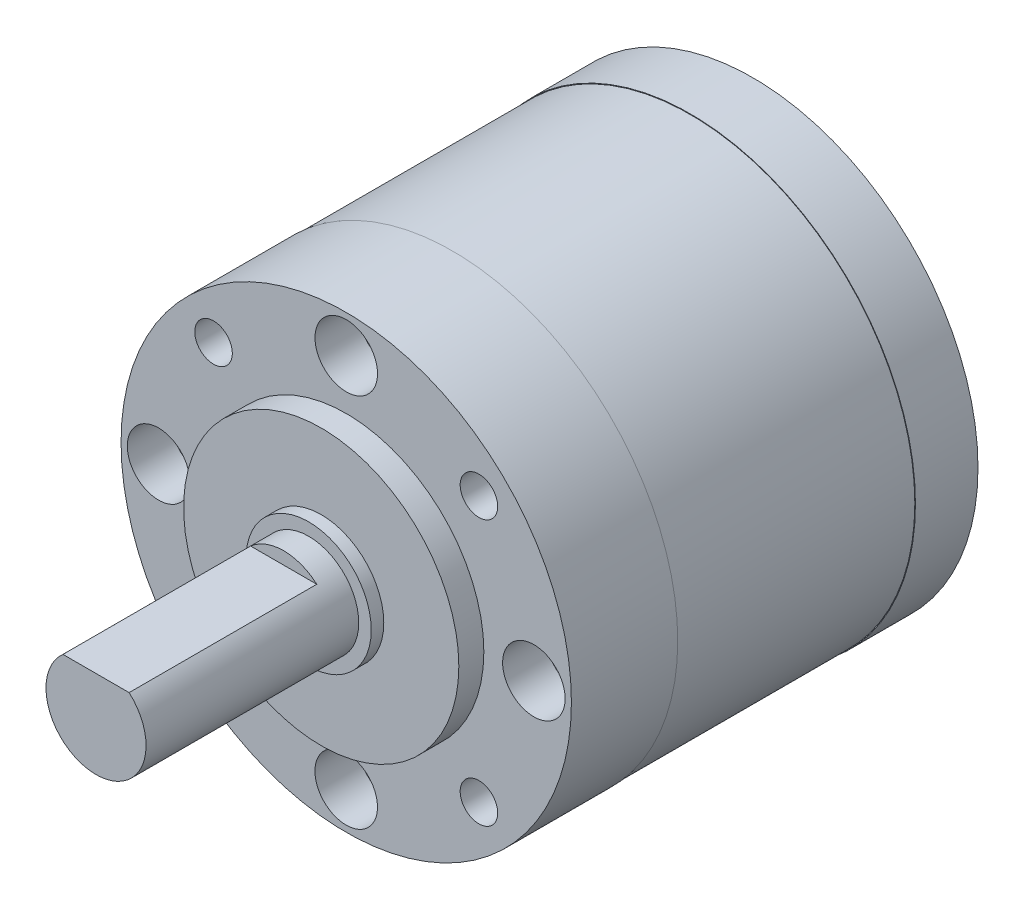
ISO-10303-21;
HEADER;
FILE_DESCRIPTION(('STEP AP214'),'2;1');
FILE_NAME('part.step','',(''),(''),'','','');
FILE_SCHEMA(('AUTOMOTIVE_DESIGN { 1 0 10303 214 1 1 1 1 }'));
ENDSEC;
DATA;
#1=APPLICATION_CONTEXT('core data for automotive mechanical design processes');
#2=APPLICATION_PROTOCOL_DEFINITION('international standard','automotive_design',2000,#1);
#3=PRODUCT_CONTEXT('',#1,'mechanical');
#4=PRODUCT('Part','Part','',(#3));
#5=PRODUCT_RELATED_PRODUCT_CATEGORY('part','',(#4));
#6=PRODUCT_DEFINITION_FORMATION('','',#4);
#7=PRODUCT_DEFINITION_CONTEXT('part definition',#1,'design');
#8=PRODUCT_DEFINITION('design','',#6,#7);
#9=PRODUCT_DEFINITION_SHAPE('','',#8);
#10=(LENGTH_UNIT() NAMED_UNIT(*) SI_UNIT(.MILLI.,.METRE.));
#11=(NAMED_UNIT(*) PLANE_ANGLE_UNIT() SI_UNIT($,.RADIAN.));
#12=(NAMED_UNIT(*) SI_UNIT($,.STERADIAN.) SOLID_ANGLE_UNIT());
#13=UNCERTAINTY_MEASURE_WITH_UNIT(LENGTH_MEASURE(1.E-05),#10,'distance_accuracy_value','');
#14=(GEOMETRIC_REPRESENTATION_CONTEXT(3) GLOBAL_UNCERTAINTY_ASSIGNED_CONTEXT((#13)) GLOBAL_UNIT_ASSIGNED_CONTEXT((#10,
#11,#12)) REPRESENTATION_CONTEXT('',''));
#15=CARTESIAN_POINT('',(0.,0.,0.));
#16=DIRECTION('',(0.,0.,1.));
#17=DIRECTION('',(1.,0.,0.));
#18=AXIS2_PLACEMENT_3D('',#15,#16,#17);
#19=CARTESIAN_POINT('',(0.,0.,8.5));
#20=DIRECTION('',(0.,0.,-1.));
#21=DIRECTION('',(-1.,0.,0.));
#22=AXIS2_PLACEMENT_3D('',#19,#20,#21);
#23=CYLINDRICAL_SURFACE('',#22,18.);
#24=CARTESIAN_POINT('',(0.,0.,8.5));
#25=DIRECTION('',(0.,0.,1.));
#26=DIRECTION('',(1.,0.,0.));
#27=AXIS2_PLACEMENT_3D('',#24,#25,#26);
#28=CIRCLE('',#27,18.);
#29=CARTESIAN_POINT('',(18.,0.,8.5));
#30=VERTEX_POINT('',#29);
#31=EDGE_CURVE('E105',#30,#30,#28,.T.);
#32=ORIENTED_EDGE('',*,*,#31,.F.);
#33=EDGE_LOOP('',(#32));
#34=FACE_BOUND('',#33,.T.);
#35=CARTESIAN_POINT('',(0.,0.,0.));
#36=DIRECTION('',(0.,0.,1.));
#37=DIRECTION('',(1.,0.,0.));
#38=AXIS2_PLACEMENT_3D('',#35,#36,#37);
#39=CIRCLE('',#38,18.);
#40=CARTESIAN_POINT('',(18.,0.,0.));
#41=VERTEX_POINT('',#40);
#42=EDGE_CURVE('E104',#41,#41,#39,.T.);
#43=ORIENTED_EDGE('',*,*,#42,.T.);
#44=EDGE_LOOP('',(#43));
#45=FACE_BOUND('',#44,.T.);
#46=ADVANCED_FACE('F35',(#34,#45),#23,.T.);
#47=CARTESIAN_POINT('',(0.,0.,8.5));
#48=DIRECTION('',(0.,0.,1.));
#49=DIRECTION('',(1.,0.,0.));
#50=AXIS2_PLACEMENT_3D('',#47,#48,#49);
#51=PLANE('',#50);
#52=CARTESIAN_POINT('',(0.,-15.,8.5));
#53=DIRECTION('',(0.,0.,1.));
#54=DIRECTION('',(-1.,0.,0.));
#55=AXIS2_PLACEMENT_3D('',#52,#53,#54);
#56=CIRCLE('',#55,2.5);
#57=CARTESIAN_POINT('',(-2.5,-15.,8.5));
#58=VERTEX_POINT('',#57);
#59=EDGE_CURVE('E134',#58,#58,#56,.T.);
#60=ORIENTED_EDGE('',*,*,#59,.F.);
#61=EDGE_LOOP('',(#60));
#62=FACE_BOUND('',#61,.T.);
#63=CARTESIAN_POINT('',(15.,1.57116660247941E-13,8.5));
#64=DIRECTION('',(0.,0.,1.));
#65=DIRECTION('',(0.,-1.,0.));
#66=AXIS2_PLACEMENT_3D('',#63,#64,#65);
#67=CIRCLE('',#66,2.5);
#68=CARTESIAN_POINT('',(15.,-2.49999999999984,8.5));
#69=VERTEX_POINT('',#68);
#70=EDGE_CURVE('E144',#69,#69,#67,.T.);
#71=ORIENTED_EDGE('',*,*,#70,.F.);
#72=EDGE_LOOP('',(#71));
#73=FACE_BOUND('',#72,.T.);
#74=CARTESIAN_POINT('',(-15.,0.,8.5));
#75=DIRECTION('',(0.,0.,1.));
#76=DIRECTION('',(0.,1.,0.));
#77=AXIS2_PLACEMENT_3D('',#74,#75,#76);
#78=CIRCLE('',#77,2.5);
#79=CARTESIAN_POINT('',(-15.,2.49999999999995,8.5));
#80=VERTEX_POINT('',#79);
#81=EDGE_CURVE('E132',#80,#80,#78,.T.);
#82=ORIENTED_EDGE('',*,*,#81,.F.);
#83=EDGE_LOOP('',(#82));
#84=FACE_BOUND('',#83,.T.);
#85=CARTESIAN_POINT('',(0.,15.,8.5));
#86=DIRECTION('',(0.,0.,1.));
#87=DIRECTION('',(1.,0.,0.));
#88=AXIS2_PLACEMENT_3D('',#85,#86,#87);
#89=CIRCLE('',#88,2.5);
#90=CARTESIAN_POINT('',(2.5,15.,8.5));
#91=VERTEX_POINT('',#90);
#92=EDGE_CURVE('E124',#91,#91,#89,.T.);
#93=ORIENTED_EDGE('',*,*,#92,.F.);
#94=EDGE_LOOP('',(#93));
#95=FACE_BOUND('',#94,.T.);
#96=CARTESIAN_POINT('',(-10.6066017177982,-10.6066017177983,8.5));
#97=DIRECTION('',(0.,0.,1.));
#98=DIRECTION('',(-0.707106781186551,0.707106781186544,0.));
#99=AXIS2_PLACEMENT_3D('',#96,#97,#98);
#100=CIRCLE('',#99,1.5);
#101=CARTESIAN_POINT('',(-11.667261889578,-9.54594154601845,8.5));
#102=VERTEX_POINT('',#101);
#103=EDGE_CURVE('E162',#102,#102,#100,.T.);
#104=ORIENTED_EDGE('',*,*,#103,.F.);
#105=EDGE_LOOP('',(#104));
#106=FACE_BOUND('',#105,.T.);
#107=CARTESIAN_POINT('',(10.6066017177983,-10.6066017177981,8.5));
#108=DIRECTION('',(0.,0.,1.));
#109=DIRECTION('',(-0.707106781186541,-0.707106781186554,0.));
#110=AXIS2_PLACEMENT_3D('',#107,#108,#109);
#111=CIRCLE('',#110,1.5);
#112=CARTESIAN_POINT('',(9.54594154601849,-11.667261889578,8.5));
#113=VERTEX_POINT('',#112);
#114=EDGE_CURVE('E171',#113,#113,#111,.T.);
#115=ORIENTED_EDGE('',*,*,#114,.F.);
#116=EDGE_LOOP('',(#115));
#117=FACE_BOUND('',#116,.T.);
#118=CARTESIAN_POINT('',(10.6066017177981,10.6066017177983,8.5));
#119=DIRECTION('',(0.,0.,1.));
#120=DIRECTION('',(0.707106781186556,-0.707106781186539,0.));
#121=AXIS2_PLACEMENT_3D('',#118,#119,#120);
#122=CIRCLE('',#121,1.5);
#123=CARTESIAN_POINT('',(11.6672618895779,9.54594154601853,8.5));
#124=VERTEX_POINT('',#123);
#125=EDGE_CURVE('E120',#124,#124,#122,.T.);
#126=ORIENTED_EDGE('',*,*,#125,.F.);
#127=EDGE_LOOP('',(#126));
#128=FACE_BOUND('',#127,.T.);
#129=CARTESIAN_POINT('',(-10.6066017177982,10.6066017177982,8.5));
#130=DIRECTION('',(0.,0.,1.));
#131=DIRECTION('',(0.707106781186546,0.707106781186549,0.));
#132=AXIS2_PLACEMENT_3D('',#129,#130,#131);
#133=CIRCLE('',#132,1.5);
#134=CARTESIAN_POINT('',(-9.54594154601841,11.667261889578,8.5));
#135=VERTEX_POINT('',#134);
#136=EDGE_CURVE('E158',#135,#135,#133,.T.);
#137=ORIENTED_EDGE('',*,*,#136,.F.);
#138=EDGE_LOOP('',(#137));
#139=FACE_BOUND('',#138,.T.);
#140=CARTESIAN_POINT('',(0.,0.,8.5));
#141=DIRECTION('',(0.,0.,1.));
#142=DIRECTION('',(1.,0.,0.));
#143=AXIS2_PLACEMENT_3D('',#140,#141,#142);
#144=CIRCLE('',#143,11.);
#145=CARTESIAN_POINT('',(11.,0.,8.5));
#146=VERTEX_POINT('',#145);
#147=EDGE_CURVE('E87',#146,#146,#144,.T.);
#148=ORIENTED_EDGE('',*,*,#147,.F.);
#149=EDGE_LOOP('',(#148));
#150=FACE_BOUND('',#149,.T.);
#151=ORIENTED_EDGE('',*,*,#31,.T.);
#152=EDGE_LOOP('',(#151));
#153=FACE_BOUND('',#152,.T.);
#154=ADVANCED_FACE('F224',(#62,#73,#84,#95,#106,#117,#128,#139,#150,#153),#51,.T.);
#155=CARTESIAN_POINT('',(0.,0.,0.));
#156=DIRECTION('',(0.,0.,1.));
#157=DIRECTION('',(1.,0.,0.));
#158=AXIS2_PLACEMENT_3D('',#155,#156,#157);
#159=PLANE('',#158);
#160=CARTESIAN_POINT('',(0.,0.,0.));
#161=DIRECTION('',(0.,0.,1.));
#162=DIRECTION('',(1.,0.,0.));
#163=AXIS2_PLACEMENT_3D('',#160,#161,#162);
#164=CIRCLE('',#163,17.95);
#165=CARTESIAN_POINT('',(17.95,0.,0.));
#166=VERTEX_POINT('',#165);
#167=EDGE_CURVE('E44',#166,#166,#164,.F.);
#168=ORIENTED_EDGE('',*,*,#167,.F.);
#169=EDGE_LOOP('',(#168));
#170=FACE_BOUND('',#169,.T.);
#171=ORIENTED_EDGE('',*,*,#42,.F.);
#172=EDGE_LOOP('',(#171));
#173=FACE_BOUND('',#172,.T.);
#174=ADVANCED_FACE('F229',(#170,#173),#159,.F.);
#175=CARTESIAN_POINT('',(0.,0.,-19.));
#176=DIRECTION('',(0.,0.,1.));
#177=DIRECTION('',(1.,0.,0.));
#178=AXIS2_PLACEMENT_3D('',#175,#176,#177);
#179=CYLINDRICAL_SURFACE('',#178,17.95);
#180=CARTESIAN_POINT('',(0.,0.,-19.));
#181=DIRECTION('',(0.,0.,-1.));
#182=DIRECTION('',(-1.,0.,0.));
#183=AXIS2_PLACEMENT_3D('',#180,#181,#182);
#184=CIRCLE('',#183,17.95);
#185=CARTESIAN_POINT('',(-17.95,0.,-19.));
#186=VERTEX_POINT('',#185);
#187=EDGE_CURVE('E99',#186,#186,#184,.T.);
#188=ORIENTED_EDGE('',*,*,#187,.F.);
#189=EDGE_LOOP('',(#188));
#190=FACE_BOUND('',#189,.T.);
#191=ORIENTED_EDGE('',*,*,#167,.T.);
#192=EDGE_LOOP('',(#191));
#193=FACE_BOUND('',#192,.T.);
#194=ADVANCED_FACE('F209',(#190,#193),#179,.T.);
#195=CARTESIAN_POINT('',(0.,0.,-24.));
#196=DIRECTION('',(0.,0.,1.));
#197=DIRECTION('',(1.,0.,0.));
#198=AXIS2_PLACEMENT_3D('',#195,#196,#197);
#199=CYLINDRICAL_SURFACE('',#198,18.);
#200=CARTESIAN_POINT('',(0.,0.,-24.));
#201=DIRECTION('',(0.,0.,-1.));
#202=DIRECTION('',(-1.,0.,0.));
#203=AXIS2_PLACEMENT_3D('',#200,#201,#202);
#204=CIRCLE('',#203,18.);
#205=CARTESIAN_POINT('',(-18.,0.,-24.));
#206=VERTEX_POINT('',#205);
#207=EDGE_CURVE('E96',#206,#206,#204,.T.);
#208=ORIENTED_EDGE('',*,*,#207,.F.);
#209=EDGE_LOOP('',(#208));
#210=FACE_BOUND('',#209,.T.);
#211=CARTESIAN_POINT('',(0.,0.,-19.));
#212=DIRECTION('',(0.,0.,-1.));
#213=DIRECTION('',(-1.,0.,0.));
#214=AXIS2_PLACEMENT_3D('',#211,#212,#213);
#215=CIRCLE('',#214,18.);
#216=CARTESIAN_POINT('',(-18.,0.,-19.));
#217=VERTEX_POINT('',#216);
#218=EDGE_CURVE('E93',#217,#217,#215,.T.);
#219=ORIENTED_EDGE('',*,*,#218,.T.);
#220=EDGE_LOOP('',(#219));
#221=FACE_BOUND('',#220,.T.);
#222=ADVANCED_FACE('F203',(#210,#221),#199,.T.);
#223=CARTESIAN_POINT('',(0.,0.,-24.));
#224=DIRECTION('',(0.,0.,-1.));
#225=DIRECTION('',(-1.,0.,0.));
#226=AXIS2_PLACEMENT_3D('',#223,#224,#225);
#227=PLANE('',#226);
#228=CARTESIAN_POINT('',(0.,0.,-24.));
#229=DIRECTION('',(0.,0.,-1.));
#230=DIRECTION('',(-1.,0.,0.));
#231=AXIS2_PLACEMENT_3D('',#228,#229,#230);
#232=CIRCLE('',#231,11.);
#233=CARTESIAN_POINT('',(-11.,0.,-24.));
#234=VERTEX_POINT('',#233);
#235=EDGE_CURVE('E115',#234,#234,#232,.T.);
#236=ORIENTED_EDGE('',*,*,#235,.F.);
#237=EDGE_LOOP('',(#236));
#238=FACE_BOUND('',#237,.T.);
#239=ORIENTED_EDGE('',*,*,#207,.T.);
#240=EDGE_LOOP('',(#239));
#241=FACE_BOUND('',#240,.T.);
#242=ADVANCED_FACE('F199',(#238,#241),#227,.T.);
#243=CARTESIAN_POINT('',(0.,0.,-19.));
#244=DIRECTION('',(0.,0.,-1.));
#245=DIRECTION('',(-1.,0.,0.));
#246=AXIS2_PLACEMENT_3D('',#243,#244,#245);
#247=PLANE('',#246);
#248=ORIENTED_EDGE('',*,*,#187,.T.);
#249=EDGE_LOOP('',(#248));
#250=FACE_BOUND('',#249,.T.);
#251=ORIENTED_EDGE('',*,*,#218,.F.);
#252=EDGE_LOOP('',(#251));
#253=FACE_BOUND('',#252,.T.);
#254=ADVANCED_FACE('F202',(#250,#253),#247,.F.);
#255=CARTESIAN_POINT('',(0.,0.,10.5));
#256=DIRECTION('',(0.,0.,-1.));
#257=DIRECTION('',(-1.,0.,0.));
#258=AXIS2_PLACEMENT_3D('',#255,#256,#257);
#259=CYLINDRICAL_SURFACE('',#258,11.);
#260=CARTESIAN_POINT('',(0.,0.,10.5));
#261=DIRECTION('',(0.,0.,1.));
#262=DIRECTION('',(1.,0.,0.));
#263=AXIS2_PLACEMENT_3D('',#260,#261,#262);
#264=CIRCLE('',#263,11.);
#265=CARTESIAN_POINT('',(11.,0.,10.5));
#266=VERTEX_POINT('',#265);
#267=EDGE_CURVE('E90',#266,#266,#264,.T.);
#268=ORIENTED_EDGE('',*,*,#267,.F.);
#269=EDGE_LOOP('',(#268));
#270=FACE_BOUND('',#269,.T.);
#271=ORIENTED_EDGE('',*,*,#147,.T.);
#272=EDGE_LOOP('',(#271));
#273=FACE_BOUND('',#272,.T.);
#274=ADVANCED_FACE('F214',(#270,#273),#259,.T.);
#275=CARTESIAN_POINT('',(0.,0.,10.5));
#276=DIRECTION('',(0.,0.,1.));
#277=DIRECTION('',(1.,0.,0.));
#278=AXIS2_PLACEMENT_3D('',#275,#276,#277);
#279=PLANE('',#278);
#280=CARTESIAN_POINT('',(0.,0.,10.5));
#281=DIRECTION('',(0.,0.,1.));
#282=DIRECTION('',(1.,0.,0.));
#283=AXIS2_PLACEMENT_3D('',#280,#281,#282);
#284=CIRCLE('',#283,5.);
#285=CARTESIAN_POINT('',(5.,0.,10.5));
#286=VERTEX_POINT('',#285);
#287=EDGE_CURVE('E81',#286,#286,#284,.T.);
#288=ORIENTED_EDGE('',*,*,#287,.F.);
#289=EDGE_LOOP('',(#288));
#290=FACE_BOUND('',#289,.T.);
#291=ORIENTED_EDGE('',*,*,#267,.T.);
#292=EDGE_LOOP('',(#291));
#293=FACE_BOUND('',#292,.T.);
#294=ADVANCED_FACE('F220',(#290,#293),#279,.T.);
#295=CARTESIAN_POINT('',(0.,0.,11.5));
#296=DIRECTION('',(0.,0.,-1.));
#297=DIRECTION('',(-1.,0.,0.));
#298=AXIS2_PLACEMENT_3D('',#295,#296,#297);
#299=CYLINDRICAL_SURFACE('',#298,5.);
#300=CARTESIAN_POINT('',(0.,0.,11.5));
#301=DIRECTION('',(0.,0.,1.));
#302=DIRECTION('',(1.,0.,0.));
#303=AXIS2_PLACEMENT_3D('',#300,#301,#302);
#304=CIRCLE('',#303,5.);
#305=CARTESIAN_POINT('',(5.,0.,11.5));
#306=VERTEX_POINT('',#305);
#307=EDGE_CURVE('E84',#306,#306,#304,.T.);
#308=ORIENTED_EDGE('',*,*,#307,.F.);
#309=EDGE_LOOP('',(#308));
#310=FACE_BOUND('',#309,.T.);
#311=ORIENTED_EDGE('',*,*,#287,.T.);
#312=EDGE_LOOP('',(#311));
#313=FACE_BOUND('',#312,.T.);
#314=ADVANCED_FACE('F567',(#310,#313),#299,.T.);
#315=CARTESIAN_POINT('',(0.,0.,11.5));
#316=DIRECTION('',(0.,0.,1.));
#317=DIRECTION('',(1.,0.,0.));
#318=AXIS2_PLACEMENT_3D('',#315,#316,#317);
#319=PLANE('',#318);
#320=CARTESIAN_POINT('',(0.,0.,11.5));
#321=DIRECTION('',(0.,0.,1.));
#322=DIRECTION('',(1.,0.,0.));
#323=AXIS2_PLACEMENT_3D('',#320,#321,#322);
#324=CIRCLE('',#323,4.);
#325=CARTESIAN_POINT('',(4.,0.,11.5));
#326=VERTEX_POINT('',#325);
#327=EDGE_CURVE('E77',#326,#326,#324,.T.);
#328=ORIENTED_EDGE('',*,*,#327,.F.);
#329=EDGE_LOOP('',(#328));
#330=FACE_BOUND('',#329,.T.);
#331=ORIENTED_EDGE('',*,*,#307,.T.);
#332=EDGE_LOOP('',(#331));
#333=FACE_BOUND('',#332,.T.);
#334=ADVANCED_FACE('F564',(#330,#333),#319,.T.);
#335=CARTESIAN_POINT('',(0.,0.,28.5));
#336=DIRECTION('',(0.,0.,-1.));
#337=DIRECTION('',(-1.,0.,0.));
#338=AXIS2_PLACEMENT_3D('',#335,#336,#337);
#339=CYLINDRICAL_SURFACE('',#338,4.);
#340=CARTESIAN_POINT('',(0.,0.,28.5));
#341=DIRECTION('',(0.,0.,1.));
#342=DIRECTION('',(1.,0.,0.));
#343=AXIS2_PLACEMENT_3D('',#340,#341,#342);
#344=CIRCLE('',#343,4.);
#345=CARTESIAN_POINT('',(-2.64575131106459,3.,28.5));
#346=VERTEX_POINT('',#345);
#347=CARTESIAN_POINT('',(2.64575131106459,3.,28.5));
#348=VERTEX_POINT('',#347);
#349=EDGE_CURVE('E75',#346,#348,#344,.T.);
#350=ORIENTED_EDGE('',*,*,#349,.F.);
#351=DIRECTION('',(0.,0.,1.));
#352=VECTOR('',#351,1.);
#353=CARTESIAN_POINT('',(-2.64575131106459,3.,13.5));
#354=LINE('',#353,#352);
#355=CARTESIAN_POINT('',(-2.64575131106459,3.,13.5));
#356=VERTEX_POINT('',#355);
#357=EDGE_CURVE('E50',#356,#346,#354,.T.);
#358=ORIENTED_EDGE('',*,*,#357,.F.);
#359=CARTESIAN_POINT('',(0.,0.,13.5));
#360=DIRECTION('',(0.,0.,1.));
#361=DIRECTION('',(1.,0.,0.));
#362=AXIS2_PLACEMENT_3D('',#359,#360,#361);
#363=CIRCLE('',#362,4.);
#364=CARTESIAN_POINT('',(2.64575131106459,3.,13.5));
#365=VERTEX_POINT('',#364);
#366=EDGE_CURVE('E61',#365,#356,#363,.T.);
#367=ORIENTED_EDGE('',*,*,#366,.F.);
#368=DIRECTION('',(0.,0.,1.));
#369=VECTOR('',#368,1.);
#370=CARTESIAN_POINT('',(2.64575131106459,3.,13.5));
#371=LINE('',#370,#369);
#372=EDGE_CURVE('E69',#365,#348,#371,.T.);
#373=ORIENTED_EDGE('',*,*,#372,.T.);
#374=EDGE_LOOP('',(#350,#358,#367,#373));
#375=FACE_BOUND('',#374,.T.);
#376=ORIENTED_EDGE('',*,*,#327,.T.);
#377=EDGE_LOOP('',(#376));
#378=FACE_BOUND('',#377,.T.);
#379=ADVANCED_FACE('F72',(#375,#378),#339,.T.);
#380=CARTESIAN_POINT('',(0.,0.,28.5));
#381=DIRECTION('',(0.,0.,1.));
#382=DIRECTION('',(1.,0.,0.));
#383=AXIS2_PLACEMENT_3D('',#380,#381,#382);
#384=PLANE('',#383);
#385=DIRECTION('',(1.,0.,0.));
#386=VECTOR('',#385,1.);
#387=CARTESIAN_POINT('',(0.,3.,28.5));
#388=LINE('',#387,#386);
#389=EDGE_CURVE('E11',#346,#348,#388,.T.);
#390=ORIENTED_EDGE('',*,*,#389,.F.);
#391=ORIENTED_EDGE('',*,*,#349,.T.);
#392=EDGE_LOOP('',(#390,#391));
#393=FACE_BOUND('',#392,.T.);
#394=ADVANCED_FACE('F558',(#393),#384,.T.);
#395=CARTESIAN_POINT('',(0.,3.,13.5));
#396=DIRECTION('',(0.,-1.,0.));
#397=DIRECTION('',(0.,0.,-1.));
#398=AXIS2_PLACEMENT_3D('',#395,#396,#397);
#399=PLANE('',#398);
#400=ORIENTED_EDGE('',*,*,#389,.T.);
#401=ORIENTED_EDGE('',*,*,#372,.F.);
#402=DIRECTION('',(1.,0.,0.));
#403=VECTOR('',#402,1.);
#404=CARTESIAN_POINT('',(0.,3.,13.5));
#405=LINE('',#404,#403);
#406=EDGE_CURVE('E63',#356,#365,#405,.T.);
#407=ORIENTED_EDGE('',*,*,#406,.F.);
#408=ORIENTED_EDGE('',*,*,#357,.T.);
#409=EDGE_LOOP('',(#400,#401,#407,#408));
#410=FACE_BOUND('',#409,.T.);
#411=ADVANCED_FACE('F68',(#410),#399,.F.);
#412=CARTESIAN_POINT('',(0.,0.,13.5));
#413=DIRECTION('',(0.,0.,1.));
#414=DIRECTION('',(1.,0.,0.));
#415=AXIS2_PLACEMENT_3D('',#412,#413,#414);
#416=PLANE('',#415);
#417=ORIENTED_EDGE('',*,*,#366,.T.);
#418=ORIENTED_EDGE('',*,*,#406,.T.);
#419=EDGE_LOOP('',(#417,#418));
#420=FACE_BOUND('',#419,.T.);
#421=ADVANCED_FACE('F62',(#420),#416,.T.);
#422=CARTESIAN_POINT('',(0.,0.,-20.));
#423=DIRECTION('',(0.,0.,-1.));
#424=DIRECTION('',(-1.,0.,0.));
#425=AXIS2_PLACEMENT_3D('',#422,#423,#424);
#426=CYLINDRICAL_SURFACE('',#425,11.);
#427=CARTESIAN_POINT('',(0.,0.,-20.));
#428=DIRECTION('',(0.,0.,-1.));
#429=DIRECTION('',(-1.,0.,0.));
#430=AXIS2_PLACEMENT_3D('',#427,#428,#429);
#431=CIRCLE('',#430,11.);
#432=CARTESIAN_POINT('',(-11.,0.,-20.));
#433=VERTEX_POINT('',#432);
#434=EDGE_CURVE('E66',#433,#433,#431,.T.);
#435=ORIENTED_EDGE('',*,*,#434,.F.);
#436=EDGE_LOOP('',(#435));
#437=FACE_BOUND('',#436,.T.);
#438=ORIENTED_EDGE('',*,*,#235,.T.);
#439=EDGE_LOOP('',(#438));
#440=FACE_BOUND('',#439,.T.);
#441=ADVANCED_FACE('F197',(#437,#440),#426,.F.);
#442=CARTESIAN_POINT('',(0.,0.,-20.));
#443=DIRECTION('',(0.,0.,-1.));
#444=DIRECTION('',(-1.,0.,0.));
#445=AXIS2_PLACEMENT_3D('',#442,#443,#444);
#446=PLANE('',#445);
#447=CARTESIAN_POINT('',(0.,0.,-20.));
#448=DIRECTION('',(0.,0.,-1.));
#449=DIRECTION('',(-1.,0.,0.));
#450=AXIS2_PLACEMENT_3D('',#447,#448,#449);
#451=CIRCLE('',#450,4.);
#452=CARTESIAN_POINT('',(-4.,0.,-20.));
#453=VERTEX_POINT('',#452);
#454=EDGE_CURVE('E112',#453,#453,#451,.T.);
#455=ORIENTED_EDGE('',*,*,#454,.F.);
#456=EDGE_LOOP('',(#455));
#457=FACE_BOUND('',#456,.T.);
#458=ORIENTED_EDGE('',*,*,#434,.T.);
#459=EDGE_LOOP('',(#458));
#460=FACE_BOUND('',#459,.T.);
#461=ADVANCED_FACE('F271',(#457,#460),#446,.T.);
#462=CARTESIAN_POINT('',(0.,0.,-7.));
#463=DIRECTION('',(0.,0.,-1.));
#464=DIRECTION('',(-1.,0.,0.));
#465=AXIS2_PLACEMENT_3D('',#462,#463,#464);
#466=CYLINDRICAL_SURFACE('',#465,4.);
#467=ORIENTED_EDGE('',*,*,#454,.T.);
#468=EDGE_LOOP('',(#467));
#469=FACE_BOUND('',#468,.T.);
#470=CARTESIAN_POINT('',(0.,0.,-7.));
#471=DIRECTION('',(0.,0.,-1.));
#472=DIRECTION('',(-1.,0.,0.));
#473=AXIS2_PLACEMENT_3D('',#470,#471,#472);
#474=CIRCLE('',#473,4.);
#475=CARTESIAN_POINT('',(-4.,0.,-7.));
#476=VERTEX_POINT('',#475);
#477=EDGE_CURVE('E116',#476,#476,#474,.T.);
#478=ORIENTED_EDGE('',*,*,#477,.F.);
#479=EDGE_LOOP('',(#478));
#480=FACE_BOUND('',#479,.T.);
#481=ADVANCED_FACE('F281',(#469,#480),#466,.F.);
#482=CARTESIAN_POINT('',(0.,0.,-7.));
#483=DIRECTION('',(0.,0.,-1.));
#484=DIRECTION('',(-1.,0.,0.));
#485=AXIS2_PLACEMENT_3D('',#482,#483,#484);
#486=PLANE('',#485);
#487=ORIENTED_EDGE('',*,*,#477,.T.);
#488=EDGE_LOOP('',(#487));
#489=FACE_BOUND('',#488,.T.);
#490=ADVANCED_FACE('F291',(#489),#486,.T.);
#491=CARTESIAN_POINT('',(-10.6066017177982,10.6066017177982,-1.5));
#492=DIRECTION('',(0.,0.,1.));
#493=DIRECTION('',(1.,0.,0.));
#494=AXIS2_PLACEMENT_3D('',#491,#492,#493);
#495=CYLINDRICAL_SURFACE('',#494,1.5);
#496=CARTESIAN_POINT('',(-10.6066017177982,10.6066017177982,-1.5));
#497=DIRECTION('',(0.,0.,1.));
#498=DIRECTION('',(0.707106781186546,0.707106781186549,0.));
#499=AXIS2_PLACEMENT_3D('',#496,#497,#498);
#500=CIRCLE('',#499,1.5);
#501=CARTESIAN_POINT('',(-9.54594154601841,11.667261889578,-1.5));
#502=VERTEX_POINT('',#501);
#503=EDGE_CURVE('E182',#502,#502,#500,.T.);
#504=ORIENTED_EDGE('',*,*,#503,.F.);
#505=EDGE_LOOP('',(#504));
#506=FACE_BOUND('',#505,.T.);
#507=ORIENTED_EDGE('',*,*,#136,.T.);
#508=EDGE_LOOP('',(#507));
#509=FACE_BOUND('',#508,.T.);
#510=ADVANCED_FACE('F301',(#506,#509),#495,.F.);
#511=CARTESIAN_POINT('',(-10.6066017177982,10.6066017177982,-1.5));
#512=DIRECTION('',(0.,0.,1.));
#513=DIRECTION('',(0.707106781186546,0.707106781186549,0.));
#514=AXIS2_PLACEMENT_3D('',#511,#512,#513);
#515=PLANE('',#514);
#516=ORIENTED_EDGE('',*,*,#503,.T.);
#517=EDGE_LOOP('',(#516));
#518=FACE_BOUND('',#517,.T.);
#519=ADVANCED_FACE('F325',(#518),#515,.T.);
#520=CARTESIAN_POINT('',(10.6066017177981,10.6066017177983,-1.5));
#521=DIRECTION('',(0.,0.,1.));
#522=DIRECTION('',(1.,0.,0.));
#523=AXIS2_PLACEMENT_3D('',#520,#521,#522);
#524=CYLINDRICAL_SURFACE('',#523,1.5);
#525=CARTESIAN_POINT('',(10.6066017177981,10.6066017177983,-1.5));
#526=DIRECTION('',(0.,0.,1.));
#527=DIRECTION('',(0.707106781186556,-0.707106781186539,0.));
#528=AXIS2_PLACEMENT_3D('',#525,#526,#527);
#529=CIRCLE('',#528,1.5);
#530=CARTESIAN_POINT('',(11.6672618895779,9.54594154601853,-1.5));
#531=VERTEX_POINT('',#530);
#532=EDGE_CURVE('E177',#531,#531,#529,.T.);
#533=ORIENTED_EDGE('',*,*,#532,.F.);
#534=EDGE_LOOP('',(#533));
#535=FACE_BOUND('',#534,.T.);
#536=ORIENTED_EDGE('',*,*,#125,.T.);
#537=EDGE_LOOP('',(#536));
#538=FACE_BOUND('',#537,.T.);
#539=ADVANCED_FACE('F335',(#535,#538),#524,.F.);
#540=CARTESIAN_POINT('',(10.6066017177981,10.6066017177983,-1.5));
#541=DIRECTION('',(0.,0.,1.));
#542=DIRECTION('',(0.707106781186556,-0.707106781186539,0.));
#543=AXIS2_PLACEMENT_3D('',#540,#541,#542);
#544=PLANE('',#543);
#545=ORIENTED_EDGE('',*,*,#532,.T.);
#546=EDGE_LOOP('',(#545));
#547=FACE_BOUND('',#546,.T.);
#548=ADVANCED_FACE('F345',(#547),#544,.T.);
#549=CARTESIAN_POINT('',(10.6066017177983,-10.6066017177981,-1.5));
#550=DIRECTION('',(0.,0.,1.));
#551=DIRECTION('',(1.,0.,0.));
#552=AXIS2_PLACEMENT_3D('',#549,#550,#551);
#553=CYLINDRICAL_SURFACE('',#552,1.5);
#554=CARTESIAN_POINT('',(10.6066017177983,-10.6066017177981,-1.5));
#555=DIRECTION('',(0.,0.,1.));
#556=DIRECTION('',(-0.707106781186541,-0.707106781186554,0.));
#557=AXIS2_PLACEMENT_3D('',#554,#555,#556);
#558=CIRCLE('',#557,1.5);
#559=CARTESIAN_POINT('',(9.54594154601849,-11.667261889578,-1.5));
#560=VERTEX_POINT('',#559);
#561=EDGE_CURVE('E168',#560,#560,#558,.T.);
#562=ORIENTED_EDGE('',*,*,#561,.F.);
#563=EDGE_LOOP('',(#562));
#564=FACE_BOUND('',#563,.T.);
#565=ORIENTED_EDGE('',*,*,#114,.T.);
#566=EDGE_LOOP('',(#565));
#567=FACE_BOUND('',#566,.T.);
#568=ADVANCED_FACE('F355',(#564,#567),#553,.F.);
#569=CARTESIAN_POINT('',(10.6066017177983,-10.6066017177981,-1.5));
#570=DIRECTION('',(0.,0.,1.));
#571=DIRECTION('',(-0.707106781186541,-0.707106781186554,0.));
#572=AXIS2_PLACEMENT_3D('',#569,#570,#571);
#573=PLANE('',#572);
#574=ORIENTED_EDGE('',*,*,#561,.T.);
#575=EDGE_LOOP('',(#574));
#576=FACE_BOUND('',#575,.T.);
#577=ADVANCED_FACE('F379',(#576),#573,.T.);
#578=CARTESIAN_POINT('',(-10.6066017177982,-10.6066017177983,-1.5));
#579=DIRECTION('',(0.,0.,1.));
#580=DIRECTION('',(1.,0.,0.));
#581=AXIS2_PLACEMENT_3D('',#578,#579,#580);
#582=CYLINDRICAL_SURFACE('',#581,1.5);
#583=CARTESIAN_POINT('',(-10.6066017177982,-10.6066017177983,-1.5));
#584=DIRECTION('',(0.,0.,1.));
#585=DIRECTION('',(-0.707106781186551,0.707106781186544,0.));
#586=AXIS2_PLACEMENT_3D('',#583,#584,#585);
#587=CIRCLE('',#586,1.5);
#588=CARTESIAN_POINT('',(-11.667261889578,-9.54594154601845,-1.5));
#589=VERTEX_POINT('',#588);
#590=EDGE_CURVE('E159',#589,#589,#587,.T.);
#591=ORIENTED_EDGE('',*,*,#590,.F.);
#592=EDGE_LOOP('',(#591));
#593=FACE_BOUND('',#592,.T.);
#594=ORIENTED_EDGE('',*,*,#103,.T.);
#595=EDGE_LOOP('',(#594));
#596=FACE_BOUND('',#595,.T.);
#597=ADVANCED_FACE('F389',(#593,#596),#582,.F.);
#598=CARTESIAN_POINT('',(-10.6066017177982,-10.6066017177983,-1.5));
#599=DIRECTION('',(0.,0.,1.));
#600=DIRECTION('',(-0.707106781186551,0.707106781186544,0.));
#601=AXIS2_PLACEMENT_3D('',#598,#599,#600);
#602=PLANE('',#601);
#603=ORIENTED_EDGE('',*,*,#590,.T.);
#604=EDGE_LOOP('',(#603));
#605=FACE_BOUND('',#604,.T.);
#606=ADVANCED_FACE('F411',(#605),#602,.T.);
#607=CARTESIAN_POINT('',(0.,15.,5.));
#608=DIRECTION('',(0.,0.,1.));
#609=DIRECTION('',(1.,0.,0.));
#610=AXIS2_PLACEMENT_3D('',#607,#608,#609);
#611=PLANE('',#610);
#612=CARTESIAN_POINT('',(0.,15.,5.));
#613=DIRECTION('',(0.,0.,1.));
#614=DIRECTION('',(1.,0.,0.));
#615=AXIS2_PLACEMENT_3D('',#612,#613,#614);
#616=CIRCLE('',#615,2.5);
#617=CARTESIAN_POINT('',(2.5,15.,5.));
#618=VERTEX_POINT('',#617);
#619=EDGE_CURVE('E121',#618,#618,#616,.T.);
#620=ORIENTED_EDGE('',*,*,#619,.T.);
#621=EDGE_LOOP('',(#620));
#622=FACE_BOUND('',#621,.T.);
#623=CARTESIAN_POINT('',(0.,15.,5.));
#624=DIRECTION('',(0.,0.,1.));
#625=DIRECTION('',(1.,0.,0.));
#626=AXIS2_PLACEMENT_3D('',#623,#624,#625);
#627=CIRCLE('',#626,1.5);
#628=CARTESIAN_POINT('',(1.5,15.,5.));
#629=VERTEX_POINT('',#628);
#630=EDGE_CURVE('E117',#629,#629,#627,.F.);
#631=ORIENTED_EDGE('',*,*,#630,.T.);
#632=EDGE_LOOP('',(#631));
#633=FACE_BOUND('',#632,.T.);
#634=ADVANCED_FACE('F421',(#622,#633),#611,.T.);
#635=CARTESIAN_POINT('',(0.,15.,5.));
#636=DIRECTION('',(0.,0.,1.));
#637=DIRECTION('',(1.,0.,0.));
#638=AXIS2_PLACEMENT_3D('',#635,#636,#637);
#639=CYLINDRICAL_SURFACE('',#638,2.5);
#640=ORIENTED_EDGE('',*,*,#619,.F.);
#641=EDGE_LOOP('',(#640));
#642=FACE_BOUND('',#641,.T.);
#643=ORIENTED_EDGE('',*,*,#92,.T.);
#644=EDGE_LOOP('',(#643));
#645=FACE_BOUND('',#644,.T.);
#646=ADVANCED_FACE('F314',(#642,#645),#639,.F.);
#647=CARTESIAN_POINT('',(0.,15.,-1.5));
#648=DIRECTION('',(0.,0.,1.));
#649=DIRECTION('',(1.,0.,0.));
#650=AXIS2_PLACEMENT_3D('',#647,#648,#649);
#651=PLANE('',#650);
#652=CARTESIAN_POINT('',(0.,15.,-1.5));
#653=DIRECTION('',(0.,0.,1.));
#654=DIRECTION('',(1.,0.,0.));
#655=AXIS2_PLACEMENT_3D('',#652,#653,#654);
#656=CIRCLE('',#655,1.5);
#657=CARTESIAN_POINT('',(1.5,15.,-1.5));
#658=VERTEX_POINT('',#657);
#659=EDGE_CURVE('E185',#658,#658,#656,.T.);
#660=ORIENTED_EDGE('',*,*,#659,.T.);
#661=EDGE_LOOP('',(#660));
#662=FACE_BOUND('',#661,.T.);
#663=ADVANCED_FACE('F309',(#662),#651,.T.);
#664=CARTESIAN_POINT('',(0.,15.,-1.5));
#665=DIRECTION('',(0.,0.,1.));
#666=DIRECTION('',(1.,0.,0.));
#667=AXIS2_PLACEMENT_3D('',#664,#665,#666);
#668=CYLINDRICAL_SURFACE('',#667,1.5);
#669=ORIENTED_EDGE('',*,*,#659,.F.);
#670=EDGE_LOOP('',(#669));
#671=FACE_BOUND('',#670,.T.);
#672=ORIENTED_EDGE('',*,*,#630,.F.);
#673=EDGE_LOOP('',(#672));
#674=FACE_BOUND('',#673,.T.);
#675=ADVANCED_FACE('F313',(#671,#674),#668,.F.);
#676=CARTESIAN_POINT('',(-15.,0.,5.));
#677=DIRECTION('',(0.,0.,1.));
#678=DIRECTION('',(0.,1.,0.));
#679=AXIS2_PLACEMENT_3D('',#676,#677,#678);
#680=PLANE('',#679);
#681=CARTESIAN_POINT('',(-15.,0.,5.));
#682=DIRECTION('',(0.,0.,1.));
#683=DIRECTION('',(0.,1.,0.));
#684=AXIS2_PLACEMENT_3D('',#681,#682,#683);
#685=CIRCLE('',#684,2.5);
#686=CARTESIAN_POINT('',(-15.,2.49999999999995,5.));
#687=VERTEX_POINT('',#686);
#688=EDGE_CURVE('E125',#687,#687,#685,.T.);
#689=ORIENTED_EDGE('',*,*,#688,.T.);
#690=EDGE_LOOP('',(#689));
#691=FACE_BOUND('',#690,.T.);
#692=CARTESIAN_POINT('',(-15.,0.,5.));
#693=DIRECTION('',(0.,0.,1.));
#694=DIRECTION('',(1.,0.,0.));
#695=AXIS2_PLACEMENT_3D('',#692,#693,#694);
#696=CIRCLE('',#695,1.5);
#697=CARTESIAN_POINT('',(-13.5,0.,5.));
#698=VERTEX_POINT('',#697);
#699=EDGE_CURVE('E122',#698,#698,#696,.F.);
#700=ORIENTED_EDGE('',*,*,#699,.T.);
#701=EDGE_LOOP('',(#700));
#702=FACE_BOUND('',#701,.T.);
#703=ADVANCED_FACE('F462',(#691,#702),#680,.T.);
#704=CARTESIAN_POINT('',(-15.,0.,5.));
#705=DIRECTION('',(0.,0.,1.));
#706=DIRECTION('',(1.,0.,0.));
#707=AXIS2_PLACEMENT_3D('',#704,#705,#706);
#708=CYLINDRICAL_SURFACE('',#707,2.5);
#709=ORIENTED_EDGE('',*,*,#688,.F.);
#710=EDGE_LOOP('',(#709));
#711=FACE_BOUND('',#710,.T.);
#712=ORIENTED_EDGE('',*,*,#81,.T.);
#713=EDGE_LOOP('',(#712));
#714=FACE_BOUND('',#713,.T.);
#715=ADVANCED_FACE('F434',(#711,#714),#708,.F.);
#716=CARTESIAN_POINT('',(-15.,0.,-1.5));
#717=DIRECTION('',(0.,0.,1.));
#718=DIRECTION('',(0.,1.,0.));
#719=AXIS2_PLACEMENT_3D('',#716,#717,#718);
#720=PLANE('',#719);
#721=CARTESIAN_POINT('',(-15.,0.,-1.5));
#722=DIRECTION('',(0.,0.,1.));
#723=DIRECTION('',(0.,1.,0.));
#724=AXIS2_PLACEMENT_3D('',#721,#722,#723);
#725=CIRCLE('',#724,1.5);
#726=CARTESIAN_POINT('',(-15.,1.49999999999995,-1.5));
#727=VERTEX_POINT('',#726);
#728=EDGE_CURVE('E155',#727,#727,#725,.T.);
#729=ORIENTED_EDGE('',*,*,#728,.T.);
#730=EDGE_LOOP('',(#729));
#731=FACE_BOUND('',#730,.T.);
#732=ADVANCED_FACE('F429',(#731),#720,.T.);
#733=CARTESIAN_POINT('',(-15.,0.,-1.5));
#734=DIRECTION('',(0.,0.,1.));
#735=DIRECTION('',(1.,0.,0.));
#736=AXIS2_PLACEMENT_3D('',#733,#734,#735);
#737=CYLINDRICAL_SURFACE('',#736,1.5);
#738=ORIENTED_EDGE('',*,*,#728,.F.);
#739=EDGE_LOOP('',(#738));
#740=FACE_BOUND('',#739,.T.);
#741=ORIENTED_EDGE('',*,*,#699,.F.);
#742=EDGE_LOOP('',(#741));
#743=FACE_BOUND('',#742,.T.);
#744=ADVANCED_FACE('F433',(#740,#743),#737,.F.);
#745=CARTESIAN_POINT('',(0.,-15.,5.));
#746=DIRECTION('',(0.,0.,1.));
#747=DIRECTION('',(-1.,0.,0.));
#748=AXIS2_PLACEMENT_3D('',#745,#746,#747);
#749=PLANE('',#748);
#750=CARTESIAN_POINT('',(0.,-15.,5.));
#751=DIRECTION('',(0.,0.,1.));
#752=DIRECTION('',(-1.,0.,0.));
#753=AXIS2_PLACEMENT_3D('',#750,#751,#752);
#754=CIRCLE('',#753,2.5);
#755=CARTESIAN_POINT('',(-2.5,-15.,5.));
#756=VERTEX_POINT('',#755);
#757=EDGE_CURVE('E128',#756,#756,#754,.T.);
#758=ORIENTED_EDGE('',*,*,#757,.T.);
#759=EDGE_LOOP('',(#758));
#760=FACE_BOUND('',#759,.T.);
#761=CARTESIAN_POINT('',(0.,-15.,5.));
#762=DIRECTION('',(0.,0.,1.));
#763=DIRECTION('',(1.,0.,0.));
#764=AXIS2_PLACEMENT_3D('',#761,#762,#763);
#765=CIRCLE('',#764,1.5);
#766=CARTESIAN_POINT('',(1.5,-15.,5.));
#767=VERTEX_POINT('',#766);
#768=EDGE_CURVE('E126',#767,#767,#765,.F.);
#769=ORIENTED_EDGE('',*,*,#768,.T.);
#770=EDGE_LOOP('',(#769));
#771=FACE_BOUND('',#770,.T.);
#772=ADVANCED_FACE('F497',(#760,#771),#749,.T.);
#773=CARTESIAN_POINT('',(0.,-15.,5.));
#774=DIRECTION('',(0.,0.,1.));
#775=DIRECTION('',(1.,0.,0.));
#776=AXIS2_PLACEMENT_3D('',#773,#774,#775);
#777=CYLINDRICAL_SURFACE('',#776,2.5);
#778=ORIENTED_EDGE('',*,*,#757,.F.);
#779=EDGE_LOOP('',(#778));
#780=FACE_BOUND('',#779,.T.);
#781=ORIENTED_EDGE('',*,*,#59,.T.);
#782=EDGE_LOOP('',(#781));
#783=FACE_BOUND('',#782,.T.);
#784=ADVANCED_FACE('F507',(#780,#783),#777,.F.);
#785=CARTESIAN_POINT('',(15.,1.57116660247941E-13,5.));
#786=DIRECTION('',(0.,0.,1.));
#787=DIRECTION('',(0.,-1.,0.));
#788=AXIS2_PLACEMENT_3D('',#785,#786,#787);
#789=PLANE('',#788);
#790=CARTESIAN_POINT('',(15.,1.57116660247941E-13,5.));
#791=DIRECTION('',(0.,0.,1.));
#792=DIRECTION('',(0.,-1.,0.));
#793=AXIS2_PLACEMENT_3D('',#790,#791,#792);
#794=CIRCLE('',#793,2.5);
#795=CARTESIAN_POINT('',(15.,-2.49999999999984,5.));
#796=VERTEX_POINT('',#795);
#797=EDGE_CURVE('E139',#796,#796,#794,.T.);
#798=ORIENTED_EDGE('',*,*,#797,.T.);
#799=EDGE_LOOP('',(#798));
#800=FACE_BOUND('',#799,.T.);
#801=CARTESIAN_POINT('',(15.,1.57116660247941E-13,5.));
#802=DIRECTION('',(0.,0.,1.));
#803=DIRECTION('',(1.,0.,0.));
#804=AXIS2_PLACEMENT_3D('',#801,#802,#803);
#805=CIRCLE('',#804,1.5);
#806=CARTESIAN_POINT('',(16.5,1.57116660247941E-13,5.));
#807=VERTEX_POINT('',#806);
#808=EDGE_CURVE('E38',#807,#807,#805,.F.);
#809=ORIENTED_EDGE('',*,*,#808,.T.);
#810=EDGE_LOOP('',(#809));
#811=FACE_BOUND('',#810,.T.);
#812=ADVANCED_FACE('F516',(#800,#811),#789,.T.);
#813=CARTESIAN_POINT('',(15.,1.57116660247941E-13,5.));
#814=DIRECTION('',(0.,0.,1.));
#815=DIRECTION('',(1.,0.,0.));
#816=AXIS2_PLACEMENT_3D('',#813,#814,#815);
#817=CYLINDRICAL_SURFACE('',#816,2.5);
#818=ORIENTED_EDGE('',*,*,#797,.F.);
#819=EDGE_LOOP('',(#818));
#820=FACE_BOUND('',#819,.T.);
#821=ORIENTED_EDGE('',*,*,#70,.T.);
#822=EDGE_LOOP('',(#821));
#823=FACE_BOUND('',#822,.T.);
#824=ADVANCED_FACE('F401',(#820,#823),#817,.F.);
#825=CARTESIAN_POINT('',(0.,-15.,-1.5));
#826=DIRECTION('',(0.,0.,1.));
#827=DIRECTION('',(-1.,0.,0.));
#828=AXIS2_PLACEMENT_3D('',#825,#826,#827);
#829=PLANE('',#828);
#830=CARTESIAN_POINT('',(0.,-15.,-1.5));
#831=DIRECTION('',(0.,0.,1.));
#832=DIRECTION('',(-1.,0.,0.));
#833=AXIS2_PLACEMENT_3D('',#830,#831,#832);
#834=CIRCLE('',#833,1.5);
#835=CARTESIAN_POINT('',(-1.5,-15.,-1.5));
#836=VERTEX_POINT('',#835);
#837=EDGE_CURVE('E165',#836,#836,#834,.T.);
#838=ORIENTED_EDGE('',*,*,#837,.T.);
#839=EDGE_LOOP('',(#838));
#840=FACE_BOUND('',#839,.T.);
#841=ADVANCED_FACE('F397',(#840),#829,.T.);
#842=CARTESIAN_POINT('',(0.,-15.,-1.5));
#843=DIRECTION('',(0.,0.,1.));
#844=DIRECTION('',(1.,0.,0.));
#845=AXIS2_PLACEMENT_3D('',#842,#843,#844);
#846=CYLINDRICAL_SURFACE('',#845,1.5);
#847=ORIENTED_EDGE('',*,*,#837,.F.);
#848=EDGE_LOOP('',(#847));
#849=FACE_BOUND('',#848,.T.);
#850=ORIENTED_EDGE('',*,*,#768,.F.);
#851=EDGE_LOOP('',(#850));
#852=FACE_BOUND('',#851,.T.);
#853=ADVANCED_FACE('F368',(#849,#852),#846,.F.);
#854=CARTESIAN_POINT('',(15.,1.57116660247941E-13,-1.5));
#855=DIRECTION('',(0.,0.,1.));
#856=DIRECTION('',(0.,-1.,0.));
#857=AXIS2_PLACEMENT_3D('',#854,#855,#856);
#858=PLANE('',#857);
#859=CARTESIAN_POINT('',(15.,1.57116660247941E-13,-1.5));
#860=DIRECTION('',(0.,0.,1.));
#861=DIRECTION('',(0.,-1.,0.));
#862=AXIS2_PLACEMENT_3D('',#859,#860,#861);
#863=CIRCLE('',#862,1.5);
#864=CARTESIAN_POINT('',(15.,-1.49999999999984,-1.5));
#865=VERTEX_POINT('',#864);
#866=EDGE_CURVE('E174',#865,#865,#863,.T.);
#867=ORIENTED_EDGE('',*,*,#866,.T.);
#868=EDGE_LOOP('',(#867));
#869=FACE_BOUND('',#868,.T.);
#870=ADVANCED_FACE('F363',(#869),#858,.T.);
#871=CARTESIAN_POINT('',(15.,1.57116660247941E-13,-1.5));
#872=DIRECTION('',(0.,0.,1.));
#873=DIRECTION('',(1.,0.,0.));
#874=AXIS2_PLACEMENT_3D('',#871,#872,#873);
#875=CYLINDRICAL_SURFACE('',#874,1.5);
#876=ORIENTED_EDGE('',*,*,#866,.F.);
#877=EDGE_LOOP('',(#876));
#878=FACE_BOUND('',#877,.T.);
#879=ORIENTED_EDGE('',*,*,#808,.F.);
#880=EDGE_LOOP('',(#879));
#881=FACE_BOUND('',#880,.T.);
#882=ADVANCED_FACE('F367',(#878,#881),#875,.F.);
#883=CLOSED_SHELL('',(#46,#154,#174,#194,#222,#242,#254,#274,#294,#314,#334,#379,#394,#411,#421,
#441,#461,#481,#490,#510,#519,#539,#548,#568,#577,#597,#606,#634,#646,#663,#675,#703,#715,#732,
#744,#772,#784,#812,#824,#841,#853,#870,#882));
#884=MANIFOLD_SOLID_BREP('B2',#883);
#885=ADVANCED_BREP_SHAPE_REPRESENTATION('',(#18,#884),#14);
#886=SHAPE_DEFINITION_REPRESENTATION(#9,#885);
ENDSEC;
END-ISO-10303-21;
